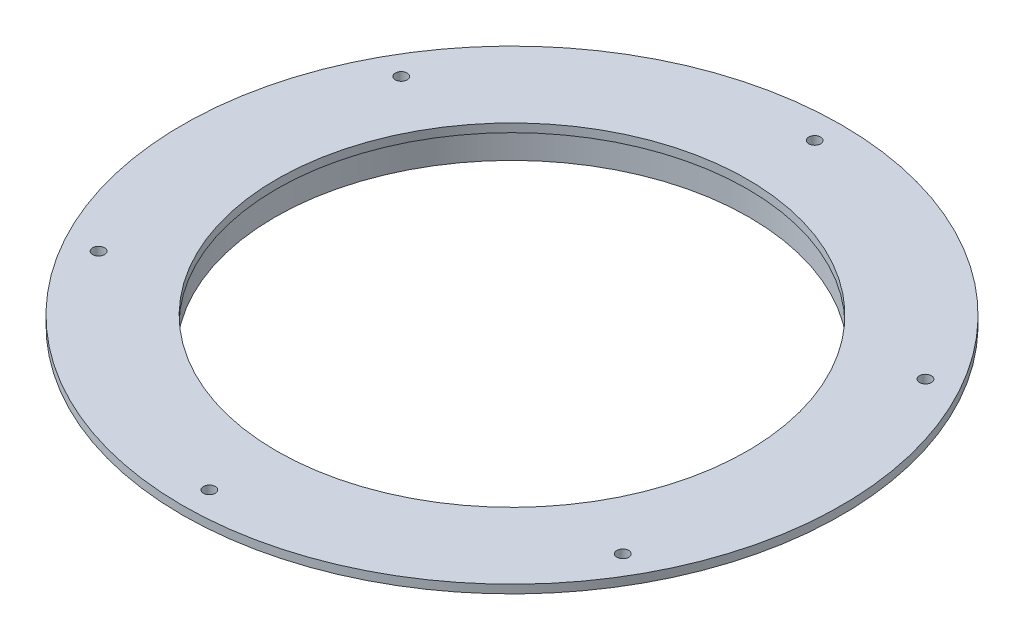
ISO-10303-21;
HEADER;
FILE_DESCRIPTION(('STEP AP214'),'2;1');
FILE_NAME('part.step','',(''),(''),'','','');
FILE_SCHEMA(('AUTOMOTIVE_DESIGN { 1 0 10303 214 1 1 1 1 }'));
ENDSEC;
DATA;
#1=APPLICATION_CONTEXT('core data for automotive mechanical design processes');
#2=APPLICATION_PROTOCOL_DEFINITION('international standard','automotive_design',2000,#1);
#3=PRODUCT_CONTEXT('',#1,'mechanical');
#4=PRODUCT('Part','Part','',(#3));
#5=PRODUCT_RELATED_PRODUCT_CATEGORY('part','',(#4));
#6=PRODUCT_DEFINITION_FORMATION('','',#4);
#7=PRODUCT_DEFINITION_CONTEXT('part definition',#1,'design');
#8=PRODUCT_DEFINITION('design','',#6,#7);
#9=PRODUCT_DEFINITION_SHAPE('','',#8);
#10=(LENGTH_UNIT() NAMED_UNIT(*) SI_UNIT(.MILLI.,.METRE.));
#11=(NAMED_UNIT(*) PLANE_ANGLE_UNIT() SI_UNIT($,.RADIAN.));
#12=(NAMED_UNIT(*) SI_UNIT($,.STERADIAN.) SOLID_ANGLE_UNIT());
#13=UNCERTAINTY_MEASURE_WITH_UNIT(LENGTH_MEASURE(1.E-05),#10,'distance_accuracy_value','');
#14=(GEOMETRIC_REPRESENTATION_CONTEXT(3) GLOBAL_UNCERTAINTY_ASSIGNED_CONTEXT((#13)) GLOBAL_UNIT_ASSIGNED_CONTEXT((#10,
#11,#12)) REPRESENTATION_CONTEXT('',''));
#15=CARTESIAN_POINT('',(0.,0.,0.));
#16=DIRECTION('',(0.,0.,1.));
#17=DIRECTION('',(1.,0.,0.));
#18=AXIS2_PLACEMENT_3D('',#15,#16,#17);
#19=CARTESIAN_POINT('',(0.,0.,0.));
#20=DIRECTION('',(0.,-1.,0.));
#21=DIRECTION('',(0.,0.,-1.));
#22=AXIS2_PLACEMENT_3D('',#19,#20,#21);
#23=CYLINDRICAL_SURFACE('',#22,92.71);
#24=CARTESIAN_POINT('',(0.,9.52500000000001,0.));
#25=DIRECTION('',(0.,-1.,0.));
#26=DIRECTION('',(0.,0.,-1.));
#27=AXIS2_PLACEMENT_3D('',#24,#25,#26);
#28=CIRCLE('',#27,92.71);
#29=CARTESIAN_POINT('',(0.,9.52500000000001,-92.71));
#30=VERTEX_POINT('',#29);
#31=EDGE_CURVE('E55',#30,#30,#28,.T.);
#32=ORIENTED_EDGE('',*,*,#31,.T.);
#33=EDGE_LOOP('',(#32));
#34=FACE_BOUND('',#33,.T.);
#35=CARTESIAN_POINT('',(0.,0.,0.));
#36=DIRECTION('',(0.,-1.,0.));
#37=DIRECTION('',(0.,0.,-1.));
#38=AXIS2_PLACEMENT_3D('',#35,#36,#37);
#39=CIRCLE('',#38,92.71);
#40=CARTESIAN_POINT('',(0.,0.,-92.71));
#41=VERTEX_POINT('',#40);
#42=EDGE_CURVE('E10',#41,#41,#39,.T.);
#43=ORIENTED_EDGE('',*,*,#42,.F.);
#44=EDGE_LOOP('',(#43));
#45=FACE_BOUND('',#44,.T.);
#46=ADVANCED_FACE('F33',(#34,#45),#23,.T.);
#47=CARTESIAN_POINT('',(0.,0.,-89.535));
#48=DIRECTION('',(0.,-1.,0.));
#49=DIRECTION('',(0.,0.,-1.));
#50=AXIS2_PLACEMENT_3D('',#47,#48,#49);
#51=PLANE('',#50);
#52=ORIENTED_EDGE('',*,*,#42,.T.);
#53=EDGE_LOOP('',(#52));
#54=FACE_BOUND('',#53,.T.);
#55=CARTESIAN_POINT('',(0.,0.,0.));
#56=DIRECTION('',(0.,-1.,0.));
#57=DIRECTION('',(0.,0.,-1.));
#58=AXIS2_PLACEMENT_3D('',#55,#56,#57);
#59=CIRCLE('',#58,89.535);
#60=CARTESIAN_POINT('',(0.,0.,-89.535));
#61=VERTEX_POINT('',#60);
#62=EDGE_CURVE('E39',#61,#61,#59,.T.);
#63=ORIENTED_EDGE('',*,*,#62,.F.);
#64=EDGE_LOOP('',(#63));
#65=FACE_BOUND('',#64,.T.);
#66=ADVANCED_FACE('F138',(#54,#65),#51,.T.);
#67=CARTESIAN_POINT('',(0.,0.,0.));
#68=DIRECTION('',(0.,-1.,0.));
#69=DIRECTION('',(0.,0.,-1.));
#70=AXIS2_PLACEMENT_3D('',#67,#68,#69);
#71=CYLINDRICAL_SURFACE('',#70,89.535);
#72=ORIENTED_EDGE('',*,*,#62,.T.);
#73=EDGE_LOOP('',(#72));
#74=FACE_BOUND('',#73,.T.);
#75=CARTESIAN_POINT('',(0.,9.52500000000001,0.));
#76=DIRECTION('',(0.,-1.,0.));
#77=DIRECTION('',(0.,0.,-1.));
#78=AXIS2_PLACEMENT_3D('',#75,#76,#77);
#79=CIRCLE('',#78,89.535);
#80=CARTESIAN_POINT('',(0.,9.52500000000001,-89.535));
#81=VERTEX_POINT('',#80);
#82=EDGE_CURVE('E43',#81,#81,#79,.T.);
#83=ORIENTED_EDGE('',*,*,#82,.F.);
#84=EDGE_LOOP('',(#83));
#85=FACE_BOUND('',#84,.T.);
#86=ADVANCED_FACE('F142',(#74,#85),#71,.F.);
#87=CARTESIAN_POINT('',(0.,9.525,0.));
#88=DIRECTION('',(0.,-1.,0.));
#89=DIRECTION('',(0.,0.,-1.));
#90=AXIS2_PLACEMENT_3D('',#87,#88,#89);
#91=PLANE('',#90);
#92=CARTESIAN_POINT('',(0.,9.525,0.));
#93=DIRECTION('',(0.,-1.,0.));
#94=DIRECTION('',(0.,0.,-1.));
#95=AXIS2_PLACEMENT_3D('',#92,#93,#94);
#96=CIRCLE('',#95,88.9);
#97=CARTESIAN_POINT('',(0.,9.525,-88.9));
#98=VERTEX_POINT('',#97);
#99=EDGE_CURVE('E94',#98,#98,#96,.T.);
#100=ORIENTED_EDGE('',*,*,#99,.F.);
#101=EDGE_LOOP('',(#100));
#102=FACE_BOUND('',#101,.T.);
#103=ORIENTED_EDGE('',*,*,#82,.T.);
#104=EDGE_LOOP('',(#103));
#105=FACE_BOUND('',#104,.T.);
#106=ADVANCED_FACE('F107',(#102,#105),#91,.T.);
#107=CARTESIAN_POINT('',(0.,12.7,-124.46));
#108=DIRECTION('',(0.,1.,0.));
#109=DIRECTION('',(0.,0.,1.));
#110=AXIS2_PLACEMENT_3D('',#107,#108,#109);
#111=PLANE('',#110);
#112=CARTESIAN_POINT('',(0.,12.7,0.));
#113=DIRECTION('',(0.,1.,0.));
#114=DIRECTION('',(0.,0.,1.));
#115=AXIS2_PLACEMENT_3D('',#112,#113,#114);
#116=CIRCLE('',#115,88.9);
#117=CARTESIAN_POINT('',(0.,12.7,88.9));
#118=VERTEX_POINT('',#117);
#119=EDGE_CURVE('E97',#118,#118,#116,.T.);
#120=ORIENTED_EDGE('',*,*,#119,.F.);
#121=EDGE_LOOP('',(#120));
#122=FACE_BOUND('',#121,.T.);
#123=CARTESIAN_POINT('',(-98.9867036525606,12.7,-57.1500000000011));
#124=DIRECTION('',(0.,1.,0.));
#125=DIRECTION('',(0.,0.,1.));
#126=AXIS2_PLACEMENT_3D('',#123,#124,#125);
#127=CIRCLE('',#126,2.2479);
#128=CARTESIAN_POINT('',(-98.9867036525606,12.7,-54.9021000000011));
#129=VERTEX_POINT('',#128);
#130=EDGE_CURVE('E91',#129,#129,#127,.T.);
#131=ORIENTED_EDGE('',*,*,#130,.F.);
#132=EDGE_LOOP('',(#131));
#133=FACE_BOUND('',#132,.T.);
#134=CARTESIAN_POINT('',(-98.9867036525618,12.7,57.149999999999));
#135=DIRECTION('',(0.,1.,0.));
#136=DIRECTION('',(0.,0.,1.));
#137=AXIS2_PLACEMENT_3D('',#134,#135,#136);
#138=CIRCLE('',#137,2.2479);
#139=CARTESIAN_POINT('',(-98.9867036525618,12.7,59.397899999999));
#140=VERTEX_POINT('',#139);
#141=EDGE_CURVE('E85',#140,#140,#138,.T.);
#142=ORIENTED_EDGE('',*,*,#141,.F.);
#143=EDGE_LOOP('',(#142));
#144=FACE_BOUND('',#143,.T.);
#145=CARTESIAN_POINT('',(0.,12.7,114.3));
#146=DIRECTION('',(0.,1.,0.));
#147=DIRECTION('',(0.,0.,1.));
#148=AXIS2_PLACEMENT_3D('',#145,#146,#147);
#149=CIRCLE('',#148,2.2479);
#150=CARTESIAN_POINT('',(0.,12.7,116.5479));
#151=VERTEX_POINT('',#150);
#152=EDGE_CURVE('E79',#151,#151,#149,.T.);
#153=ORIENTED_EDGE('',*,*,#152,.F.);
#154=EDGE_LOOP('',(#153));
#155=FACE_BOUND('',#154,.T.);
#156=CARTESIAN_POINT('',(98.986703652561,12.7,57.1500000000004));
#157=DIRECTION('',(0.,1.,0.));
#158=DIRECTION('',(0.,0.,1.));
#159=AXIS2_PLACEMENT_3D('',#156,#157,#158);
#160=CIRCLE('',#159,2.2479);
#161=CARTESIAN_POINT('',(98.986703652561,12.7,59.3979000000004));
#162=VERTEX_POINT('',#161);
#163=EDGE_CURVE('E73',#162,#162,#160,.T.);
#164=ORIENTED_EDGE('',*,*,#163,.F.);
#165=EDGE_LOOP('',(#164));
#166=FACE_BOUND('',#165,.T.);
#167=CARTESIAN_POINT('',(98.9867036525614,12.7,-57.1499999999997));
#168=DIRECTION('',(0.,1.,0.));
#169=DIRECTION('',(0.,0.,1.));
#170=AXIS2_PLACEMENT_3D('',#167,#168,#169);
#171=CIRCLE('',#170,2.2479);
#172=CARTESIAN_POINT('',(98.9867036525614,12.7,-54.9020999999997));
#173=VERTEX_POINT('',#172);
#174=EDGE_CURVE('E67',#173,#173,#171,.T.);
#175=ORIENTED_EDGE('',*,*,#174,.F.);
#176=EDGE_LOOP('',(#175));
#177=FACE_BOUND('',#176,.T.);
#178=CARTESIAN_POINT('',(0.,12.7,-114.3));
#179=DIRECTION('',(0.,1.,0.));
#180=DIRECTION('',(0.,0.,1.));
#181=AXIS2_PLACEMENT_3D('',#178,#179,#180);
#182=CIRCLE('',#181,2.2479);
#183=CARTESIAN_POINT('',(0.,12.7,-112.0521));
#184=VERTEX_POINT('',#183);
#185=EDGE_CURVE('E61',#184,#184,#182,.T.);
#186=ORIENTED_EDGE('',*,*,#185,.F.);
#187=EDGE_LOOP('',(#186));
#188=FACE_BOUND('',#187,.T.);
#189=CARTESIAN_POINT('',(0.,12.7,0.));
#190=DIRECTION('',(0.,-1.,0.));
#191=DIRECTION('',(0.,0.,-1.));
#192=AXIS2_PLACEMENT_3D('',#189,#190,#191);
#193=CIRCLE('',#192,124.46);
#194=CARTESIAN_POINT('',(0.,12.7,-124.46));
#195=VERTEX_POINT('',#194);
#196=EDGE_CURVE('E47',#195,#195,#193,.T.);
#197=ORIENTED_EDGE('',*,*,#196,.F.);
#198=EDGE_LOOP('',(#197));
#199=FACE_BOUND('',#198,.T.);
#200=ADVANCED_FACE('F103',(#122,#133,#144,#155,#166,#177,#188,#199),#111,.T.);
#201=CARTESIAN_POINT('',(0.,0.,0.));
#202=DIRECTION('',(0.,-1.,0.));
#203=DIRECTION('',(0.,0.,-1.));
#204=AXIS2_PLACEMENT_3D('',#201,#202,#203);
#205=CYLINDRICAL_SURFACE('',#204,124.46);
#206=ORIENTED_EDGE('',*,*,#196,.T.);
#207=EDGE_LOOP('',(#206));
#208=FACE_BOUND('',#207,.T.);
#209=CARTESIAN_POINT('',(0.,9.52500000000001,0.));
#210=DIRECTION('',(0.,-1.,0.));
#211=DIRECTION('',(0.,0.,-1.));
#212=AXIS2_PLACEMENT_3D('',#209,#210,#211);
#213=CIRCLE('',#212,124.46);
#214=CARTESIAN_POINT('',(0.,9.525,-124.46));
#215=VERTEX_POINT('',#214);
#216=EDGE_CURVE('E52',#215,#215,#213,.T.);
#217=ORIENTED_EDGE('',*,*,#216,.F.);
#218=EDGE_LOOP('',(#217));
#219=FACE_BOUND('',#218,.T.);
#220=ADVANCED_FACE('F106',(#208,#219),#205,.T.);
#221=CARTESIAN_POINT('',(0.,9.52500000000001,-92.71));
#222=DIRECTION('',(0.,-1.,0.));
#223=DIRECTION('',(0.,0.,-1.));
#224=AXIS2_PLACEMENT_3D('',#221,#222,#223);
#225=PLANE('',#224);
#226=CARTESIAN_POINT('',(-98.9867036525606,9.52500000000001,-57.1500000000011));
#227=DIRECTION('',(0.,-1.,0.));
#228=DIRECTION('',(0.,0.,-1.));
#229=AXIS2_PLACEMENT_3D('',#226,#227,#228);
#230=CIRCLE('',#229,2.2479);
#231=CARTESIAN_POINT('',(-98.9867036525606,9.52500000000001,-59.3979000000011));
#232=VERTEX_POINT('',#231);
#233=EDGE_CURVE('E88',#232,#232,#230,.T.);
#234=ORIENTED_EDGE('',*,*,#233,.F.);
#235=EDGE_LOOP('',(#234));
#236=FACE_BOUND('',#235,.T.);
#237=CARTESIAN_POINT('',(-98.9867036525618,9.52500000000001,57.149999999999));
#238=DIRECTION('',(0.,-1.,0.));
#239=DIRECTION('',(0.,0.,-1.));
#240=AXIS2_PLACEMENT_3D('',#237,#238,#239);
#241=CIRCLE('',#240,2.2479);
#242=CARTESIAN_POINT('',(-98.9867036525618,9.52500000000001,54.902099999999));
#243=VERTEX_POINT('',#242);
#244=EDGE_CURVE('E82',#243,#243,#241,.T.);
#245=ORIENTED_EDGE('',*,*,#244,.F.);
#246=EDGE_LOOP('',(#245));
#247=FACE_BOUND('',#246,.T.);
#248=CARTESIAN_POINT('',(0.,9.52500000000001,114.3));
#249=DIRECTION('',(0.,-1.,0.));
#250=DIRECTION('',(0.,0.,-1.));
#251=AXIS2_PLACEMENT_3D('',#248,#249,#250);
#252=CIRCLE('',#251,2.2479);
#253=CARTESIAN_POINT('',(0.,9.52500000000001,112.0521));
#254=VERTEX_POINT('',#253);
#255=EDGE_CURVE('E76',#254,#254,#252,.T.);
#256=ORIENTED_EDGE('',*,*,#255,.F.);
#257=EDGE_LOOP('',(#256));
#258=FACE_BOUND('',#257,.T.);
#259=CARTESIAN_POINT('',(98.986703652561,9.52500000000001,57.1500000000004));
#260=DIRECTION('',(0.,-1.,0.));
#261=DIRECTION('',(0.,0.,-1.));
#262=AXIS2_PLACEMENT_3D('',#259,#260,#261);
#263=CIRCLE('',#262,2.2479);
#264=CARTESIAN_POINT('',(98.986703652561,9.52500000000001,54.9021000000004));
#265=VERTEX_POINT('',#264);
#266=EDGE_CURVE('E70',#265,#265,#263,.T.);
#267=ORIENTED_EDGE('',*,*,#266,.F.);
#268=EDGE_LOOP('',(#267));
#269=FACE_BOUND('',#268,.T.);
#270=CARTESIAN_POINT('',(98.9867036525614,9.52500000000001,-57.1499999999997));
#271=DIRECTION('',(0.,-1.,0.));
#272=DIRECTION('',(0.,0.,-1.));
#273=AXIS2_PLACEMENT_3D('',#270,#271,#272);
#274=CIRCLE('',#273,2.2479);
#275=CARTESIAN_POINT('',(98.9867036525614,9.52500000000001,-59.3978999999997));
#276=VERTEX_POINT('',#275);
#277=EDGE_CURVE('E64',#276,#276,#274,.T.);
#278=ORIENTED_EDGE('',*,*,#277,.F.);
#279=EDGE_LOOP('',(#278));
#280=FACE_BOUND('',#279,.T.);
#281=CARTESIAN_POINT('',(0.,9.52500000000001,-114.3));
#282=DIRECTION('',(0.,-1.,0.));
#283=DIRECTION('',(0.,0.,-1.));
#284=AXIS2_PLACEMENT_3D('',#281,#282,#283);
#285=CIRCLE('',#284,2.2479);
#286=CARTESIAN_POINT('',(0.,9.52500000000001,-116.5479));
#287=VERTEX_POINT('',#286);
#288=EDGE_CURVE('E58',#287,#287,#285,.T.);
#289=ORIENTED_EDGE('',*,*,#288,.F.);
#290=EDGE_LOOP('',(#289));
#291=FACE_BOUND('',#290,.T.);
#292=ORIENTED_EDGE('',*,*,#216,.T.);
#293=EDGE_LOOP('',(#292));
#294=FACE_BOUND('',#293,.T.);
#295=ORIENTED_EDGE('',*,*,#31,.F.);
#296=EDGE_LOOP('',(#295));
#297=FACE_BOUND('',#296,.T.);
#298=ADVANCED_FACE('F125',(#236,#247,#258,#269,#280,#291,#294,#297),#225,.T.);
#299=CARTESIAN_POINT('',(0.,12.7,-114.3));
#300=DIRECTION('',(0.,1.,0.));
#301=DIRECTION('',(0.,0.,1.));
#302=AXIS2_PLACEMENT_3D('',#299,#300,#301);
#303=CYLINDRICAL_SURFACE('',#302,2.2479);
#304=ORIENTED_EDGE('',*,*,#185,.T.);
#305=EDGE_LOOP('',(#304));
#306=FACE_BOUND('',#305,.T.);
#307=ORIENTED_EDGE('',*,*,#288,.T.);
#308=EDGE_LOOP('',(#307));
#309=FACE_BOUND('',#308,.T.);
#310=ADVANCED_FACE('F131',(#306,#309),#303,.F.);
#311=CARTESIAN_POINT('',(98.9867036525614,12.7,-57.1499999999997));
#312=DIRECTION('',(0.,1.,0.));
#313=DIRECTION('',(0.,0.,1.));
#314=AXIS2_PLACEMENT_3D('',#311,#312,#313);
#315=CYLINDRICAL_SURFACE('',#314,2.2479);
#316=ORIENTED_EDGE('',*,*,#174,.T.);
#317=EDGE_LOOP('',(#316));
#318=FACE_BOUND('',#317,.T.);
#319=ORIENTED_EDGE('',*,*,#277,.T.);
#320=EDGE_LOOP('',(#319));
#321=FACE_BOUND('',#320,.T.);
#322=ADVANCED_FACE('F154',(#318,#321),#315,.F.);
#323=CARTESIAN_POINT('',(98.986703652561,12.7,57.1500000000004));
#324=DIRECTION('',(0.,1.,0.));
#325=DIRECTION('',(0.,0.,1.));
#326=AXIS2_PLACEMENT_3D('',#323,#324,#325);
#327=CYLINDRICAL_SURFACE('',#326,2.2479);
#328=ORIENTED_EDGE('',*,*,#163,.T.);
#329=EDGE_LOOP('',(#328));
#330=FACE_BOUND('',#329,.T.);
#331=ORIENTED_EDGE('',*,*,#266,.T.);
#332=EDGE_LOOP('',(#331));
#333=FACE_BOUND('',#332,.T.);
#334=ADVANCED_FACE('F158',(#330,#333),#327,.F.);
#335=CARTESIAN_POINT('',(0.,12.7,114.3));
#336=DIRECTION('',(0.,1.,0.));
#337=DIRECTION('',(0.,0.,1.));
#338=AXIS2_PLACEMENT_3D('',#335,#336,#337);
#339=CYLINDRICAL_SURFACE('',#338,2.2479);
#340=ORIENTED_EDGE('',*,*,#152,.T.);
#341=EDGE_LOOP('',(#340));
#342=FACE_BOUND('',#341,.T.);
#343=ORIENTED_EDGE('',*,*,#255,.T.);
#344=EDGE_LOOP('',(#343));
#345=FACE_BOUND('',#344,.T.);
#346=ADVANCED_FACE('F162',(#342,#345),#339,.F.);
#347=CARTESIAN_POINT('',(-98.9867036525618,12.7,57.149999999999));
#348=DIRECTION('',(0.,1.,0.));
#349=DIRECTION('',(0.,0.,1.));
#350=AXIS2_PLACEMENT_3D('',#347,#348,#349);
#351=CYLINDRICAL_SURFACE('',#350,2.2479);
#352=ORIENTED_EDGE('',*,*,#141,.T.);
#353=EDGE_LOOP('',(#352));
#354=FACE_BOUND('',#353,.T.);
#355=ORIENTED_EDGE('',*,*,#244,.T.);
#356=EDGE_LOOP('',(#355));
#357=FACE_BOUND('',#356,.T.);
#358=ADVANCED_FACE('F166',(#354,#357),#351,.F.);
#359=CARTESIAN_POINT('',(-98.9867036525606,12.7,-57.1500000000011));
#360=DIRECTION('',(0.,1.,0.));
#361=DIRECTION('',(0.,0.,1.));
#362=AXIS2_PLACEMENT_3D('',#359,#360,#361);
#363=CYLINDRICAL_SURFACE('',#362,2.2479);
#364=ORIENTED_EDGE('',*,*,#130,.T.);
#365=EDGE_LOOP('',(#364));
#366=FACE_BOUND('',#365,.T.);
#367=ORIENTED_EDGE('',*,*,#233,.T.);
#368=EDGE_LOOP('',(#367));
#369=FACE_BOUND('',#368,.T.);
#370=ADVANCED_FACE('F170',(#366,#369),#363,.F.);
#371=CARTESIAN_POINT('',(0.,0.,0.));
#372=DIRECTION('',(0.,1.,0.));
#373=DIRECTION('',(0.,0.,1.));
#374=AXIS2_PLACEMENT_3D('',#371,#372,#373);
#375=CYLINDRICAL_SURFACE('',#374,88.9);
#376=ORIENTED_EDGE('',*,*,#99,.T.);
#377=EDGE_LOOP('',(#376));
#378=FACE_BOUND('',#377,.T.);
#379=ORIENTED_EDGE('',*,*,#119,.T.);
#380=EDGE_LOOP('',(#379));
#381=FACE_BOUND('',#380,.T.);
#382=ADVANCED_FACE('F101',(#378,#381),#375,.F.);
#383=CLOSED_SHELL('',(#46,#66,#86,#106,#200,#220,#298,#310,#322,#334,#346,#358,#370,#382));
#384=MANIFOLD_SOLID_BREP('B2',#383);
#385=ADVANCED_BREP_SHAPE_REPRESENTATION('',(#18,#384),#14);
#386=SHAPE_DEFINITION_REPRESENTATION(#9,#385);
ENDSEC;
END-ISO-10303-21;
